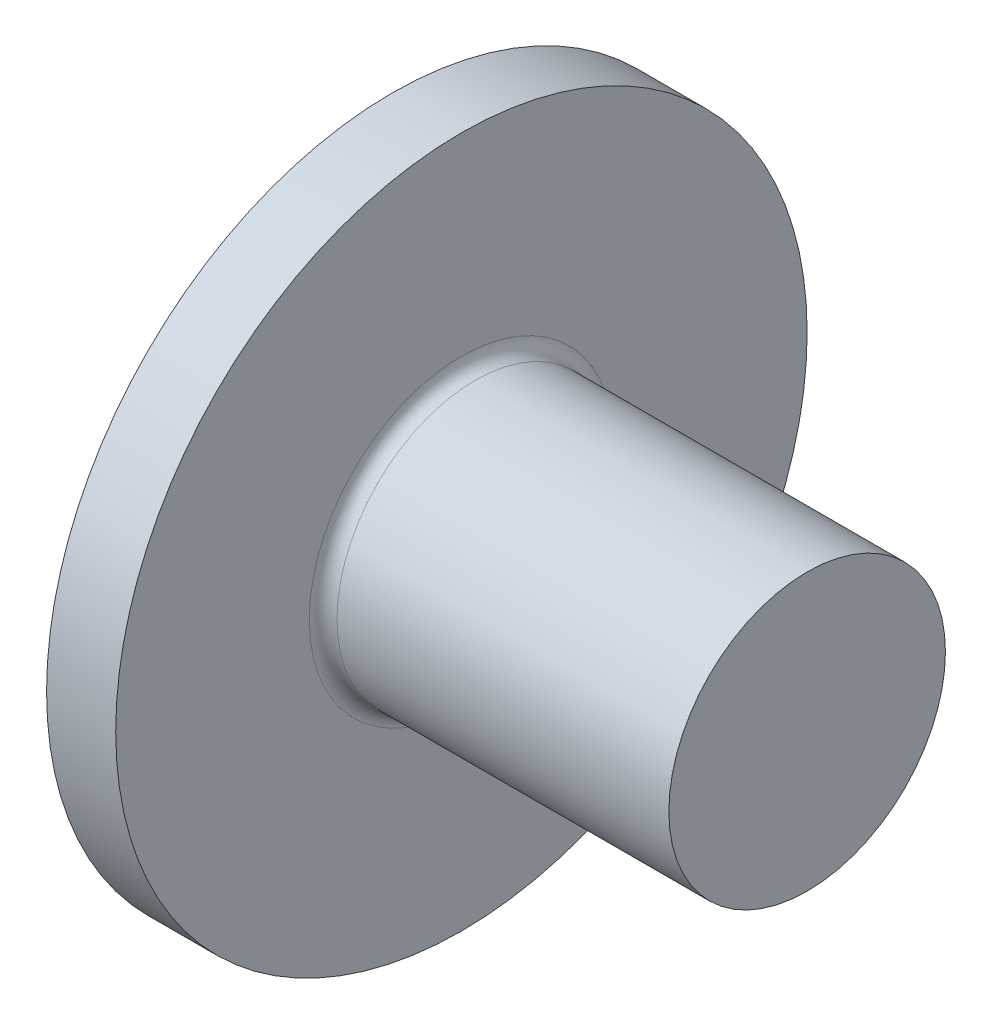
ISO-10303-21;
HEADER;
FILE_DESCRIPTION(('STEP AP214'),'2;1');
FILE_NAME('part.step','',(''),(''),'','','');
FILE_SCHEMA(('AUTOMOTIVE_DESIGN { 1 0 10303 214 1 1 1 1 }'));
ENDSEC;
DATA;
#1=APPLICATION_CONTEXT('core data for automotive mechanical design processes');
#2=APPLICATION_PROTOCOL_DEFINITION('international standard','automotive_design',2000,#1);
#3=PRODUCT_CONTEXT('',#1,'mechanical');
#4=PRODUCT('Part','Part','',(#3));
#5=PRODUCT_RELATED_PRODUCT_CATEGORY('part','',(#4));
#6=PRODUCT_DEFINITION_FORMATION('','',#4);
#7=PRODUCT_DEFINITION_CONTEXT('part definition',#1,'design');
#8=PRODUCT_DEFINITION('design','',#6,#7);
#9=PRODUCT_DEFINITION_SHAPE('','',#8);
#10=(LENGTH_UNIT() NAMED_UNIT(*) SI_UNIT(.MILLI.,.METRE.));
#11=(NAMED_UNIT(*) PLANE_ANGLE_UNIT() SI_UNIT($,.RADIAN.));
#12=(NAMED_UNIT(*) SI_UNIT($,.STERADIAN.) SOLID_ANGLE_UNIT());
#13=UNCERTAINTY_MEASURE_WITH_UNIT(LENGTH_MEASURE(1.E-05),#10,'distance_accuracy_value','');
#14=(GEOMETRIC_REPRESENTATION_CONTEXT(3) GLOBAL_UNCERTAINTY_ASSIGNED_CONTEXT((#13)) GLOBAL_UNIT_ASSIGNED_CONTEXT((#10,
#11,#12)) REPRESENTATION_CONTEXT('',''));
#15=CARTESIAN_POINT('',(0.,0.,0.));
#16=DIRECTION('',(0.,0.,1.));
#17=DIRECTION('',(1.,0.,0.));
#18=AXIS2_PLACEMENT_3D('',#15,#16,#17);
#19=CARTESIAN_POINT('',(0.,-2.15,0.514999999999999));
#20=DIRECTION('',(0.,0.,1.));
#21=DIRECTION('',(1.,0.,0.));
#22=AXIS2_PLACEMENT_3D('',#19,#20,#21);
#23=PLANE('',#22);
#24=CARTESIAN_POINT('',(-1.79298661274692,-1.19150572211576,0.514999999999999));
#25=CARTESIAN_POINT('',(-1.43619693826883,-1.16432131968278,0.514999999999999));
#26=CARTESIAN_POINT('',(-1.07941761560723,-1.13699981932845,0.514999999999999));
#27=CARTESIAN_POINT('',(-0.365884361106665,-1.08199408818658,0.514999999999999));
#28=CARTESIAN_POINT('',(-0.00913042946924694,-1.05430985478591,0.514999999999999));
#29=CARTESIAN_POINT('',(0.704342147946593,-0.99849051732371,0.514999999999999));
#30=CARTESIAN_POINT('',(1.06106079373135,-0.970355413343281,0.515));
#31=CARTESIAN_POINT('',(1.77444976866867,-0.913501553756457,0.515));
#32=CARTESIAN_POINT('',(2.13112009806674,-0.88478280123706,0.515));
#33=CARTESIAN_POINT('',(2.86788517328833,-0.824652093056656,0.515));
#34=CARTESIAN_POINT('',(3.24797561760216,-0.7931873300006,0.515));
#35=CARTESIAN_POINT('',(4.00804997853674,-0.729017811285515,0.515000000000001));
#36=CARTESIAN_POINT('',(4.38803389587504,-0.696313064191294,0.515000000000001));
#37=CARTESIAN_POINT('',(4.95789304042274,-0.645842729737196,0.515000000000001));
#38=CARTESIAN_POINT('',(5.14783071731973,-0.628783367168781,0.515000000000001));
#39=CARTESIAN_POINT('',(5.52764992575619,-0.594057293430921,0.515000000000001));
#40=CARTESIAN_POINT('',(5.71753145749917,-0.576390584490719,0.515000000000001));
#41=CARTESIAN_POINT('',(6.09722599136996,-0.540275025810562,0.515000000000001));
#42=CARTESIAN_POINT('',(6.28703899147881,-0.521826154666185,0.515000000000001));
#43=CARTESIAN_POINT('',(6.66655622713414,-0.483821208979671,0.515000000000001));
#44=CARTESIAN_POINT('',(6.85626046127055,-0.464265120397086,0.515000000000001));
#45=CARTESIAN_POINT('',(7.04589038802165,-0.443992893773562,0.515000000000002));
#46=B_SPLINE_CURVE_WITH_KNOTS('',3,(#24,#25,#26,#27,#28,#29,#30,#31,#32,#33,#34,#35,#36,#37,#38,
#39,#40,#41,#42,#43,#44,#45),.UNSPECIFIED.,.F.,.F.,(4,2,2,2,2,2,2,2,2,2,4),(0.,1.07347147993626,
2.14695069744496,3.22042972187302,4.2939030700023,5.43807363644059,6.58223630131249,
7.15434224418944,7.72644608739511,8.29856559674446,8.87069236267526),.UNSPECIFIED.);
#47=CARTESIAN_POINT('',(2.34,-0.867712978980554,0.515));
#48=VERTEX_POINT('',#47);
#49=CARTESIAN_POINT('',(0.118084953478184,-1.04432581319673,0.514999999999999));
#50=VERTEX_POINT('',#49);
#51=EDGE_CURVE('E331',#48,#50,#46,.F.);
#52=ORIENTED_EDGE('',*,*,#51,.F.);
#53=DIRECTION('',(0.,1.,0.));
#54=VECTOR('',#53,1.);
#55=CARTESIAN_POINT('',(2.34,-2.1065246820908,0.515));
#56=LINE('',#55,#54);
#57=CARTESIAN_POINT('',(2.34,-2.1065246820908,0.515));
#58=VERTEX_POINT('',#57);
#59=EDGE_CURVE('E290',#58,#48,#56,.T.);
#60=ORIENTED_EDGE('',*,*,#59,.F.);
#61=DIRECTION('',(0.999827451413598,0.0185759898737385,0.));
#62=VECTOR('',#61,1.);
#63=CARTESIAN_POINT('',(0.,-2.15,0.514999999999999));
#64=LINE('',#63,#62);
#65=CARTESIAN_POINT('',(0.434654293272697,-2.14192447282879,0.514999999999999));
#66=VERTEX_POINT('',#65);
#67=EDGE_CURVE('E276',#66,#58,#64,.T.);
#68=ORIENTED_EDGE('',*,*,#67,.F.);
#69=CARTESIAN_POINT('',(5.8,0.,0.515000000000001));
#70=DIRECTION('',(0.,0.,1.));
#71=DIRECTION('',(1.,0.,0.));
#72=AXIS2_PLACEMENT_3D('',#69,#70,#71);
#73=CIRCLE('',#72,5.77709053070834);
#74=EDGE_CURVE('E214',#50,#66,#73,.T.);
#75=ORIENTED_EDGE('',*,*,#74,.F.);
#76=EDGE_LOOP('',(#52,#60,#68,#75));
#77=FACE_BOUND('',#76,.T.);
#78=ADVANCED_FACE('F40',(#77),#23,.F.);
#79=CARTESIAN_POINT('',(0.,2.15,-0.515));
#80=DIRECTION('',(0.,0.,-1.));
#81=DIRECTION('',(0.,1.,0.));
#82=AXIS2_PLACEMENT_3D('',#79,#80,#81);
#83=PLANE('',#82);
#84=CARTESIAN_POINT('',(-1.79298661274692,-1.19150572211576,-0.515));
#85=CARTESIAN_POINT('',(-1.43619693826883,-1.16432131968278,-0.515));
#86=CARTESIAN_POINT('',(-1.07941761560723,-1.13699981932845,-0.515));
#87=CARTESIAN_POINT('',(-0.365884361106664,-1.08199408818658,-0.515));
#88=CARTESIAN_POINT('',(-0.0091304294692464,-1.05430985478591,-0.515));
#89=CARTESIAN_POINT('',(0.704342147946593,-0.99849051732371,-0.515));
#90=CARTESIAN_POINT('',(1.06106079373135,-0.970355413343281,-0.515));
#91=CARTESIAN_POINT('',(1.77444976866867,-0.913501553756457,-0.515));
#92=CARTESIAN_POINT('',(2.13112009806674,-0.884782801237059,-0.515));
#93=CARTESIAN_POINT('',(2.86788517328833,-0.824652093056656,-0.515));
#94=CARTESIAN_POINT('',(3.24797561760216,-0.7931873300006,-0.515));
#95=CARTESIAN_POINT('',(4.00804997853675,-0.729017811285515,-0.515));
#96=CARTESIAN_POINT('',(4.38803389587504,-0.696313064191294,-0.515000000000001));
#97=CARTESIAN_POINT('',(4.95789304042275,-0.645842729737197,-0.515000000000001));
#98=CARTESIAN_POINT('',(5.14783071731973,-0.628783367168782,-0.515000000000001));
#99=CARTESIAN_POINT('',(5.52764992575619,-0.594057293430921,-0.515000000000001));
#100=CARTESIAN_POINT('',(5.71753145749917,-0.57639058449072,-0.515000000000001));
#101=CARTESIAN_POINT('',(6.09722599136996,-0.540275025810562,-0.515000000000001));
#102=CARTESIAN_POINT('',(6.28703899147882,-0.521826154666185,-0.515000000000001));
#103=CARTESIAN_POINT('',(6.66655622713415,-0.483821208979671,-0.515000000000001));
#104=CARTESIAN_POINT('',(6.85626046127055,-0.464265120397087,-0.515000000000001));
#105=CARTESIAN_POINT('',(7.04589038802165,-0.443992893773562,-0.515000000000001));
#106=B_SPLINE_CURVE_WITH_KNOTS('',3,(#84,#85,#86,#87,#88,#89,#90,#91,#92,#93,#94,#95,#96,#97,
#98,#99,#100,#101,#102,#103,#104,#105),.UNSPECIFIED.,.F.,.F.,(4,2,2,2,2,2,2,2,2,2,4),(0.,
1.07347147993626,2.14695069744496,3.22042972187302,4.2939030700023,5.4380736364406,
6.58223630131249,7.15434224418944,7.72644608739512,8.29856559674446,8.87069236267526),.UNSPECIFIED.);
#107=CARTESIAN_POINT('',(0.118084953478187,-1.04432581319674,-0.515));
#108=VERTEX_POINT('',#107);
#109=CARTESIAN_POINT('',(2.34,-0.867712978980554,-0.515));
#110=VERTEX_POINT('',#109);
#111=EDGE_CURVE('E323',#108,#110,#106,.T.);
#112=ORIENTED_EDGE('',*,*,#111,.F.);
#113=CARTESIAN_POINT('',(5.8,0.,-0.515000000000001));
#114=DIRECTION('',(0.,0.,-1.));
#115=DIRECTION('',(0.,1.,0.));
#116=AXIS2_PLACEMENT_3D('',#113,#114,#115);
#117=CIRCLE('',#116,5.77709053070834);
#118=CARTESIAN_POINT('',(0.434654293272697,-2.14192447282879,-0.515));
#119=VERTEX_POINT('',#118);
#120=EDGE_CURVE('E219',#119,#108,#117,.T.);
#121=ORIENTED_EDGE('',*,*,#120,.F.);
#122=DIRECTION('',(0.999827451413598,0.0185759898737385,0.));
#123=VECTOR('',#122,1.);
#124=CARTESIAN_POINT('',(0.,-2.15,-0.515));
#125=LINE('',#124,#123);
#126=CARTESIAN_POINT('',(2.34,-2.1065246820908,-0.515000000000001));
#127=VERTEX_POINT('',#126);
#128=EDGE_CURVE('E279',#119,#127,#125,.T.);
#129=ORIENTED_EDGE('',*,*,#128,.T.);
#130=DIRECTION('',(0.,-1.,0.));
#131=VECTOR('',#130,1.);
#132=CARTESIAN_POINT('',(2.34,2.1065246820908,-0.515));
#133=LINE('',#132,#131);
#134=EDGE_CURVE('E289',#110,#127,#133,.T.);
#135=ORIENTED_EDGE('',*,*,#134,.F.);
#136=EDGE_LOOP('',(#112,#121,#129,#135));
#137=FACE_BOUND('',#136,.T.);
#138=ADVANCED_FACE('F172',(#137),#83,.F.);
#139=CARTESIAN_POINT('',(5.8,0.,0.));
#140=DIRECTION('',(-1.,0.,0.));
#141=DIRECTION('',(0.,1.,0.));
#142=AXIS2_PLACEMENT_3D('',#139,#140,#141);
#143=SPHERICAL_SURFACE('',#142,5.8);
#144=CARTESIAN_POINT('',(2.05,0.,0.));
#145=DIRECTION('',(1.,0.,0.));
#146=DIRECTION('',(0.,0.,-1.));
#147=AXIS2_PLACEMENT_3D('',#144,#145,#146);
#148=CIRCLE('',#147,4.42464687856557);
#149=CARTESIAN_POINT('',(2.05,0.,-4.42464687856557));
#150=VERTEX_POINT('',#149);
#151=EDGE_CURVE('E312',#150,#150,#148,.F.);
#152=ORIENTED_EDGE('',*,*,#151,.T.);
#153=EDGE_LOOP('',(#152));
#154=FACE_BOUND('',#153,.T.);
#155=CARTESIAN_POINT('',(0.118084953478184,0.,0.));
#156=DIRECTION('',(1.,0.,0.));
#157=DIRECTION('',(0.,0.,-1.));
#158=AXIS2_PLACEMENT_3D('',#155,#156,#157);
#159=CIRCLE('',#158,1.16440603060489);
#160=CARTESIAN_POINT('',(0.118084953478184,-0.514999999999996,-1.04432581319673));
#161=VERTEX_POINT('',#160);
#162=EDGE_CURVE('E317',#161,#108,#159,.F.);
#163=ORIENTED_EDGE('',*,*,#162,.F.);
#164=CARTESIAN_POINT('',(5.8,-0.515000000000001,0.));
#165=DIRECTION('',(0.,-1.,0.));
#166=DIRECTION('',(0.,0.,-1.));
#167=AXIS2_PLACEMENT_3D('',#164,#165,#166);
#168=CIRCLE('',#167,5.77709053070834);
#169=CARTESIAN_POINT('',(0.434654293272697,-0.514999999999992,-2.14192447282879));
#170=VERTEX_POINT('',#169);
#171=EDGE_CURVE('E230',#161,#170,#168,.T.);
#172=ORIENTED_EDGE('',*,*,#171,.T.);
#173=CARTESIAN_POINT('',(5.83793009599905,0.,-2.04153595433537));
#174=DIRECTION('',(0.0185759898737385,0.,-0.999827451413598));
#175=DIRECTION('',(-0.999827451413598,0.,-0.0185759898737385));
#176=AXIS2_PLACEMENT_3D('',#173,#174,#175);
#177=CIRCLE('',#176,5.42869157854574);
#178=CARTESIAN_POINT('',(0.434654293272697,0.515000000000008,-2.14192447282879));
#179=VERTEX_POINT('',#178);
#180=EDGE_CURVE('E53',#170,#179,#177,.T.);
#181=ORIENTED_EDGE('',*,*,#180,.T.);
#182=CARTESIAN_POINT('',(5.8,0.515000000000001,0.));
#183=DIRECTION('',(0.,1.,0.));
#184=DIRECTION('',(0.,0.,1.));
#185=AXIS2_PLACEMENT_3D('',#182,#183,#184);
#186=CIRCLE('',#185,5.77709053070834);
#187=CARTESIAN_POINT('',(0.118084953478184,0.515000000000004,-1.04432581319673));
#188=VERTEX_POINT('',#187);
#189=EDGE_CURVE('E228',#179,#188,#186,.T.);
#190=ORIENTED_EDGE('',*,*,#189,.T.);
#191=CARTESIAN_POINT('',(0.118084953478187,1.04432581319674,-0.515));
#192=VERTEX_POINT('',#191);
#193=EDGE_CURVE('E338',#192,#188,#159,.F.);
#194=ORIENTED_EDGE('',*,*,#193,.F.);
#195=CARTESIAN_POINT('',(0.434654293272697,2.14192447282879,-0.515));
#196=VERTEX_POINT('',#195);
#197=EDGE_CURVE('E314',#192,#196,#117,.T.);
#198=ORIENTED_EDGE('',*,*,#197,.T.);
#199=CARTESIAN_POINT('',(5.83793009599905,2.04153595433537,0.));
#200=DIRECTION('',(0.0185759898737385,0.999827451413598,0.));
#201=DIRECTION('',(-0.999827451413598,0.0185759898737385,0.));
#202=AXIS2_PLACEMENT_3D('',#199,#200,#201);
#203=CIRCLE('',#202,5.42869157854574);
#204=CARTESIAN_POINT('',(0.434654293272697,2.14192447282879,0.515));
#205=VERTEX_POINT('',#204);
#206=EDGE_CURVE('E212',#196,#205,#203,.T.);
#207=ORIENTED_EDGE('',*,*,#206,.T.);
#208=CARTESIAN_POINT('',(0.118084953478184,1.04432581319673,0.514999999999999));
#209=VERTEX_POINT('',#208);
#210=EDGE_CURVE('E200',#205,#209,#73,.T.);
#211=ORIENTED_EDGE('',*,*,#210,.T.);
#212=CARTESIAN_POINT('',(0.118084953478187,0.514999999999996,1.04432581319674));
#213=VERTEX_POINT('',#212);
#214=EDGE_CURVE('E210',#213,#209,#159,.F.);
#215=ORIENTED_EDGE('',*,*,#214,.F.);
#216=CARTESIAN_POINT('',(0.434654293272697,0.514999999999993,2.14192447282879));
#217=VERTEX_POINT('',#216);
#218=EDGE_CURVE('E247',#213,#217,#186,.T.);
#219=ORIENTED_EDGE('',*,*,#218,.T.);
#220=CARTESIAN_POINT('',(5.83793009599905,0.,2.04153595433537));
#221=DIRECTION('',(0.0185759898737385,0.,0.999827451413598));
#222=DIRECTION('',(0.999827451413598,0.,-0.0185759898737385));
#223=AXIS2_PLACEMENT_3D('',#220,#221,#222);
#224=CIRCLE('',#223,5.42869157854574);
#225=CARTESIAN_POINT('',(0.434654293272697,-0.515000000000007,2.14192447282879));
#226=VERTEX_POINT('',#225);
#227=EDGE_CURVE('E217',#217,#226,#224,.T.);
#228=ORIENTED_EDGE('',*,*,#227,.T.);
#229=CARTESIAN_POINT('',(0.118084953478187,-0.515000000000003,1.04432581319674));
#230=VERTEX_POINT('',#229);
#231=EDGE_CURVE('E275',#226,#230,#168,.T.);
#232=ORIENTED_EDGE('',*,*,#231,.T.);
#233=EDGE_CURVE('E204',#50,#230,#159,.F.);
#234=ORIENTED_EDGE('',*,*,#233,.F.);
#235=ORIENTED_EDGE('',*,*,#74,.T.);
#236=CARTESIAN_POINT('',(5.83793009599905,-2.04153595433537,0.));
#237=DIRECTION('',(0.0185759898737385,-0.999827451413598,0.));
#238=DIRECTION('',(0.999827451413598,0.0185759898737385,0.));
#239=AXIS2_PLACEMENT_3D('',#236,#237,#238);
#240=CIRCLE('',#239,5.42869157854574);
#241=EDGE_CURVE('E213',#66,#119,#240,.T.);
#242=ORIENTED_EDGE('',*,*,#241,.T.);
#243=ORIENTED_EDGE('',*,*,#120,.T.);
#244=EDGE_LOOP('',(#163,#172,#181,#190,#194,#198,#207,#211,#215,#219,#228,#232,#234,#235,#242,#243));
#245=FACE_BOUND('',#244,.T.);
#246=ADVANCED_FACE('F179',(#154,#245),#143,.T.);
#247=CARTESIAN_POINT('',(-1.79298661274692,1.19150572211576,0.514999999999999));
#248=CARTESIAN_POINT('',(-1.43619693826883,1.16432131968278,0.514999999999999));
#249=CARTESIAN_POINT('',(-1.07941761560723,1.13699981932845,0.514999999999999));
#250=CARTESIAN_POINT('',(-0.365884361106665,1.08199408818658,0.514999999999999));
#251=CARTESIAN_POINT('',(-0.00913042946924678,1.05430985478591,0.514999999999999));
#252=CARTESIAN_POINT('',(0.704342147946593,0.99849051732371,0.514999999999999));
#253=CARTESIAN_POINT('',(1.06106079373135,0.970355413343281,0.515));
#254=CARTESIAN_POINT('',(1.77444976866867,0.913501553756458,0.515));
#255=CARTESIAN_POINT('',(2.13112009806674,0.88478280123706,0.515));
#256=CARTESIAN_POINT('',(2.86788517328833,0.824652093056656,0.515));
#257=CARTESIAN_POINT('',(3.24797561760217,0.7931873300006,0.515));
#258=CARTESIAN_POINT('',(4.00804997853675,0.729017811285515,0.515000000000001));
#259=CARTESIAN_POINT('',(4.38803389587504,0.696313064191294,0.515000000000001));
#260=CARTESIAN_POINT('',(4.95789304042275,0.645842729737196,0.515000000000001));
#261=CARTESIAN_POINT('',(5.14783071731973,0.628783367168781,0.515000000000001));
#262=CARTESIAN_POINT('',(5.52764992575619,0.594057293430921,0.515000000000001));
#263=CARTESIAN_POINT('',(5.71753145749917,0.576390584490719,0.515000000000001));
#264=CARTESIAN_POINT('',(6.09722599136996,0.540275025810561,0.515000000000001));
#265=CARTESIAN_POINT('',(6.28703899147882,0.521826154666184,0.515000000000001));
#266=CARTESIAN_POINT('',(6.66655622713415,0.48382120897967,0.515000000000001));
#267=CARTESIAN_POINT('',(6.85626046127055,0.464265120397086,0.515000000000001));
#268=CARTESIAN_POINT('',(7.04589038802165,0.443992893773561,0.515000000000002));
#269=B_SPLINE_CURVE_WITH_KNOTS('',3,(#247,#248,#249,#250,#251,#252,#253,#254,#255,#256,#257,
#258,#259,#260,#261,#262,#263,#264,#265,#266,#267,#268),.UNSPECIFIED.,.F.,.F.,(4,2,2,2,2,2,2,2,
2,2,4),(0.,1.07347147993626,2.14695069744496,3.22042972187302,4.2939030700023,5.4380736364406,
6.58223630131249,7.15434224418944,7.72644608739511,8.29856559674446,8.87069236267526),.UNSPECIFIED.);
#270=CARTESIAN_POINT('',(2.34,0.867712978980554,0.515));
#271=VERTEX_POINT('',#270);
#272=EDGE_CURVE('E198',#209,#271,#269,.T.);
#273=ORIENTED_EDGE('',*,*,#272,.F.);
#274=ORIENTED_EDGE('',*,*,#210,.F.);
#275=DIRECTION('',(0.999827451413598,-0.0185759898737385,0.));
#276=VECTOR('',#275,1.);
#277=CARTESIAN_POINT('',(0.,2.15,0.514999999999999));
#278=LINE('',#277,#276);
#279=CARTESIAN_POINT('',(2.34,2.1065246820908,0.515));
#280=VERTEX_POINT('',#279);
#281=EDGE_CURVE('E67',#205,#280,#278,.T.);
#282=ORIENTED_EDGE('',*,*,#281,.T.);
#283=EDGE_CURVE('E202',#271,#280,#56,.T.);
#284=ORIENTED_EDGE('',*,*,#283,.F.);
#285=EDGE_LOOP('',(#273,#274,#282,#284));
#286=FACE_BOUND('',#285,.T.);
#287=ADVANCED_FACE('F175',(#286),#23,.F.);
#288=CARTESIAN_POINT('',(-1.79298661274692,1.19150572211576,-0.515));
#289=CARTESIAN_POINT('',(-1.43619693826883,1.16432131968278,-0.515));
#290=CARTESIAN_POINT('',(-1.07941761560723,1.13699981932845,-0.515));
#291=CARTESIAN_POINT('',(-0.365884361106664,1.08199408818658,-0.515));
#292=CARTESIAN_POINT('',(-0.00913042946924602,1.05430985478591,-0.515));
#293=CARTESIAN_POINT('',(0.704342147946593,0.99849051732371,-0.515));
#294=CARTESIAN_POINT('',(1.06106079373135,0.970355413343281,-0.515));
#295=CARTESIAN_POINT('',(1.77444976866867,0.913501553756458,-0.515));
#296=CARTESIAN_POINT('',(2.13112009806674,0.88478280123706,-0.515));
#297=CARTESIAN_POINT('',(2.86788517328833,0.824652093056656,-0.515));
#298=CARTESIAN_POINT('',(3.24797561760216,0.7931873300006,-0.515));
#299=CARTESIAN_POINT('',(4.00804997853675,0.729017811285515,-0.515));
#300=CARTESIAN_POINT('',(4.38803389587504,0.696313064191294,-0.515));
#301=CARTESIAN_POINT('',(4.95789304042275,0.645842729737197,-0.515));
#302=CARTESIAN_POINT('',(5.14783071731973,0.628783367168782,-0.515));
#303=CARTESIAN_POINT('',(5.52764992575619,0.594057293430921,-0.515));
#304=CARTESIAN_POINT('',(5.71753145749917,0.57639058449072,-0.515));
#305=CARTESIAN_POINT('',(6.09722599136996,0.540275025810562,-0.515));
#306=CARTESIAN_POINT('',(6.28703899147882,0.521826154666185,-0.515000000000001));
#307=CARTESIAN_POINT('',(6.66655622713415,0.483821208979671,-0.515000000000001));
#308=CARTESIAN_POINT('',(6.85626046127055,0.464265120397087,-0.515000000000001));
#309=CARTESIAN_POINT('',(7.04589038802165,0.443992893773563,-0.515000000000001));
#310=B_SPLINE_CURVE_WITH_KNOTS('',3,(#288,#289,#290,#291,#292,#293,#294,#295,#296,#297,#298,
#299,#300,#301,#302,#303,#304,#305,#306,#307,#308,#309),.UNSPECIFIED.,.F.,.F.,(4,2,2,2,2,2,2,2,
2,2,4),(0.,1.07347147993627,2.14695069744496,3.22042972187302,4.2939030700023,5.43807363644059,
6.58223630131249,7.15434224418944,7.72644608739511,8.29856559674446,8.87069236267526),.UNSPECIFIED.);
#311=CARTESIAN_POINT('',(2.34,0.867712978980554,-0.515));
#312=VERTEX_POINT('',#311);
#313=EDGE_CURVE('E347',#312,#192,#310,.F.);
#314=ORIENTED_EDGE('',*,*,#313,.F.);
#315=CARTESIAN_POINT('',(2.34,2.1065246820908,-0.515));
#316=VERTEX_POINT('',#315);
#317=EDGE_CURVE('E291',#316,#312,#133,.T.);
#318=ORIENTED_EDGE('',*,*,#317,.F.);
#319=DIRECTION('',(0.999827451413598,-0.0185759898737385,0.));
#320=VECTOR('',#319,1.);
#321=CARTESIAN_POINT('',(0.,2.15,-0.515));
#322=LINE('',#321,#320);
#323=EDGE_CURVE('E283',#196,#316,#322,.T.);
#324=ORIENTED_EDGE('',*,*,#323,.F.);
#325=ORIENTED_EDGE('',*,*,#197,.F.);
#326=EDGE_LOOP('',(#314,#318,#324,#325));
#327=FACE_BOUND('',#326,.T.);
#328=ADVANCED_FACE('F182',(#327),#83,.F.);
#329=CARTESIAN_POINT('',(2.34,2.1065246820908,0.515));
#330=DIRECTION('',(-1.,0.,0.));
#331=DIRECTION('',(0.,0.,1.));
#332=AXIS2_PLACEMENT_3D('',#329,#330,#331);
#333=PLANE('',#332);
#334=ORIENTED_EDGE('',*,*,#59,.T.);
#335=CARTESIAN_POINT('',(2.34,0.,0.));
#336=DIRECTION('',(-1.,0.,0.));
#337=DIRECTION('',(0.,0.,1.));
#338=AXIS2_PLACEMENT_3D('',#335,#336,#337);
#339=CIRCLE('',#338,1.00903459499232);
#340=EDGE_CURVE('E335',#48,#110,#339,.F.);
#341=ORIENTED_EDGE('',*,*,#340,.T.);
#342=ORIENTED_EDGE('',*,*,#134,.T.);
#343=DIRECTION('',(0.,0.,1.));
#344=VECTOR('',#343,1.);
#345=CARTESIAN_POINT('',(2.34,-2.1065246820908,-0.515000000000001));
#346=LINE('',#345,#344);
#347=EDGE_CURVE('E285',#127,#58,#346,.T.);
#348=ORIENTED_EDGE('',*,*,#347,.T.);
#349=EDGE_LOOP('',(#334,#341,#342,#348));
#350=FACE_BOUND('',#349,.T.);
#351=ADVANCED_FACE('F192',(#350),#333,.T.);
#352=DIRECTION('',(0.,0.,1.));
#353=VECTOR('',#352,1.);
#354=CARTESIAN_POINT('',(2.34,-0.514999999999993,-2.10652468209081));
#355=LINE('',#354,#353);
#356=CARTESIAN_POINT('',(2.34,-0.514999999999993,-2.10652468209081));
#357=VERTEX_POINT('',#356);
#358=CARTESIAN_POINT('',(2.34,-0.514999999999997,-0.867712978980556));
#359=VERTEX_POINT('',#358);
#360=EDGE_CURVE('E245',#357,#359,#355,.T.);
#361=ORIENTED_EDGE('',*,*,#360,.T.);
#362=CARTESIAN_POINT('',(2.34,0.515000000000003,-0.867712978980552));
#363=VERTEX_POINT('',#362);
#364=EDGE_CURVE('E371',#359,#363,#339,.F.);
#365=ORIENTED_EDGE('',*,*,#364,.T.);
#366=DIRECTION('',(0.,0.,-1.));
#367=VECTOR('',#366,1.);
#368=CARTESIAN_POINT('',(2.34,0.514999999999993,2.10652468209081));
#369=LINE('',#368,#367);
#370=CARTESIAN_POINT('',(2.34,0.515000000000008,-2.1065246820908));
#371=VERTEX_POINT('',#370);
#372=EDGE_CURVE('E267',#363,#371,#369,.T.);
#373=ORIENTED_EDGE('',*,*,#372,.T.);
#374=DIRECTION('',(0.,-1.,0.));
#375=VECTOR('',#374,1.);
#376=CARTESIAN_POINT('',(2.34,0.515000000000008,-2.1065246820908));
#377=LINE('',#376,#375);
#378=EDGE_CURVE('E263',#371,#357,#377,.T.);
#379=ORIENTED_EDGE('',*,*,#378,.T.);
#380=EDGE_LOOP('',(#361,#365,#373,#379));
#381=FACE_BOUND('',#380,.T.);
#382=ADVANCED_FACE('F452',(#381),#333,.T.);
#383=ORIENTED_EDGE('',*,*,#317,.T.);
#384=EDGE_CURVE('E333',#312,#271,#339,.F.);
#385=ORIENTED_EDGE('',*,*,#384,.T.);
#386=ORIENTED_EDGE('',*,*,#283,.T.);
#387=DIRECTION('',(0.,0.,-1.));
#388=VECTOR('',#387,1.);
#389=CARTESIAN_POINT('',(2.34,2.1065246820908,0.515));
#390=LINE('',#389,#388);
#391=EDGE_CURVE('E286',#280,#316,#390,.T.);
#392=ORIENTED_EDGE('',*,*,#391,.T.);
#393=EDGE_LOOP('',(#383,#385,#386,#392));
#394=FACE_BOUND('',#393,.T.);
#395=ADVANCED_FACE('F376',(#394),#333,.T.);
#396=CARTESIAN_POINT('',(0.,0.514999999999992,2.15));
#397=DIRECTION('',(0.,1.,0.));
#398=DIRECTION('',(0.,0.,1.));
#399=AXIS2_PLACEMENT_3D('',#396,#397,#398);
#400=PLANE('',#399);
#401=CARTESIAN_POINT('',(-1.79298662893649,0.515000000000004,-1.19150572334907));
#402=CARTESIAN_POINT('',(-1.43619695230506,0.515000000000004,-1.16432132075638));
#403=CARTESIAN_POINT('',(-1.0794176274902,0.515000000000004,-1.13699982024121));
#404=CARTESIAN_POINT('',(-0.365884368683318,0.515000000000004,-1.08199408877401));
#405=CARTESIAN_POINT('',(-0.00913043489284162,0.515000000000004,-1.05430985520883));
#406=CARTESIAN_POINT('',(0.704342147969924,0.515000000000004,-0.998490517323278));
#407=CARTESIAN_POINT('',(1.06106079704843,0.515000000000004,-0.970355413082561));
#408=CARTESIAN_POINT('',(1.77444977857226,0.515000000000004,-0.913501552963536));
#409=CARTESIAN_POINT('',(2.1311201112631,0.515000000000004,-0.884782800172224));
#410=CARTESIAN_POINT('',(2.86788518977584,0.515000000000003,-0.824652091698035));
#411=CARTESIAN_POINT('',(3.24797563408862,0.515000000000003,-0.793187328627031));
#412=CARTESIAN_POINT('',(4.00804999502045,0.515000000000003,-0.729017809875384));
#413=CARTESIAN_POINT('',(4.38803391235703,0.515000000000003,-0.696313062759548));
#414=CARTESIAN_POINT('',(4.95789305690139,0.515000000000003,-0.645842728263865));
#415=CARTESIAN_POINT('',(5.14783073379719,0.515000000000003,-0.628783365680054));
#416=CARTESIAN_POINT('',(5.52764994223081,0.515000000000003,-0.594057291906934));
#417=CARTESIAN_POINT('',(5.71753147397213,0.515000000000003,-0.57639058294687));
#418=CARTESIAN_POINT('',(6.09722600783899,0.515000000000003,-0.540275024220593));
#419=CARTESIAN_POINT('',(6.28703900794559,0.515000000000003,-0.521826153049961));
#420=CARTESIAN_POINT('',(6.66655624359515,0.515000000000002,-0.483821207299953));
#421=CARTESIAN_POINT('',(6.85626047772805,0.515000000000002,-0.464265118680129));
#422=CARTESIAN_POINT('',(7.0458904044747,0.515000000000002,-0.443992892011578));
#423=B_SPLINE_CURVE_WITH_KNOTS('',3,(#401,#402,#403,#404,#405,#406,#407,#408,#409,#410,#411,
#412,#413,#414,#415,#416,#417,#418,#419,#420,#421,#422),.UNSPECIFIED.,.F.,.F.,(4,2,2,2,2,2,2,2,
2,2,4),(0.,1.07347148641402,2.14695071040071,3.22042974474083,4.29390310278196,5.43807366922081,
6.58223633409312,7.15434227697065,7.72644612017687,8.29856562952703,8.8706923954588),.UNSPECIFIED.);
#424=EDGE_CURVE('E367',#188,#363,#423,.T.);
#425=ORIENTED_EDGE('',*,*,#424,.F.);
#426=ORIENTED_EDGE('',*,*,#189,.F.);
#427=DIRECTION('',(0.999827451413598,0.,0.0185759898737385));
#428=VECTOR('',#427,1.);
#429=CARTESIAN_POINT('',(0.,0.515000000000008,-2.15));
#430=LINE('',#429,#428);
#431=EDGE_CURVE('E239',#179,#371,#430,.T.);
#432=ORIENTED_EDGE('',*,*,#431,.T.);
#433=ORIENTED_EDGE('',*,*,#372,.F.);
#434=EDGE_LOOP('',(#425,#426,#432,#433));
#435=FACE_BOUND('',#434,.T.);
#436=ADVANCED_FACE('F372',(#435),#400,.F.);
#437=CARTESIAN_POINT('',(0.,-0.514999999999992,-2.15));
#438=DIRECTION('',(0.,-1.,0.));
#439=DIRECTION('',(1.,0.,0.));
#440=AXIS2_PLACEMENT_3D('',#437,#438,#439);
#441=PLANE('',#440);
#442=CARTESIAN_POINT('',(-1.79298661274692,-0.514999999999995,-1.19150572211576));
#443=CARTESIAN_POINT('',(-1.43619693826883,-0.514999999999995,-1.16432131968278));
#444=CARTESIAN_POINT('',(-1.07941761560723,-0.514999999999995,-1.13699981932845));
#445=CARTESIAN_POINT('',(-0.365884361106664,-0.514999999999995,-1.08199408818658));
#446=CARTESIAN_POINT('',(-0.00913042946924656,-0.514999999999996,-1.05430985478591));
#447=CARTESIAN_POINT('',(0.704342147946593,-0.514999999999996,-0.998490517323712));
#448=CARTESIAN_POINT('',(1.06106079373135,-0.514999999999996,-0.970355413343283));
#449=CARTESIAN_POINT('',(1.77444976866867,-0.514999999999997,-0.913501553756459));
#450=CARTESIAN_POINT('',(2.13112009806674,-0.514999999999997,-0.884782801237061));
#451=CARTESIAN_POINT('',(2.86788517328833,-0.514999999999997,-0.824652093056658));
#452=CARTESIAN_POINT('',(3.24797561760217,-0.514999999999998,-0.793187330000602));
#453=CARTESIAN_POINT('',(4.00804997853675,-0.514999999999998,-0.729017811285517));
#454=CARTESIAN_POINT('',(4.38803389587504,-0.514999999999998,-0.696313064191296));
#455=CARTESIAN_POINT('',(4.95789304042275,-0.514999999999999,-0.645842729737198));
#456=CARTESIAN_POINT('',(5.14783071731973,-0.514999999999999,-0.628783367168783));
#457=CARTESIAN_POINT('',(5.52764992575619,-0.514999999999999,-0.594057293430922));
#458=CARTESIAN_POINT('',(5.71753145749917,-0.514999999999999,-0.576390584490721));
#459=CARTESIAN_POINT('',(6.09722599136996,-0.514999999999999,-0.540275025810563));
#460=CARTESIAN_POINT('',(6.28703899147882,-0.514999999999999,-0.521826154666186));
#461=CARTESIAN_POINT('',(6.66655622713415,-0.515,-0.483821208979672));
#462=CARTESIAN_POINT('',(6.85626046127055,-0.515,-0.464265120397088));
#463=CARTESIAN_POINT('',(7.04589038802165,-0.515,-0.443992893773563));
#464=B_SPLINE_CURVE_WITH_KNOTS('',3,(#442,#443,#444,#445,#446,#447,#448,#449,#450,#451,#452,
#453,#454,#455,#456,#457,#458,#459,#460,#461,#462,#463),.UNSPECIFIED.,.F.,.F.,(4,2,2,2,2,2,2,2,
2,2,4),(0.,1.07347147993626,2.14695069744496,3.22042972187302,4.2939030700023,5.43807363644059,
6.58223630131249,7.15434224418944,7.72644608739511,8.29856559674446,8.87069236267526),.UNSPECIFIED.);
#465=EDGE_CURVE('E252',#359,#161,#464,.F.);
#466=ORIENTED_EDGE('',*,*,#465,.F.);
#467=ORIENTED_EDGE('',*,*,#360,.F.);
#468=DIRECTION('',(0.999827451413598,0.,0.0185759898737385));
#469=VECTOR('',#468,1.);
#470=CARTESIAN_POINT('',(0.,-0.514999999999992,-2.15));
#471=LINE('',#470,#469);
#472=EDGE_CURVE('E236',#170,#357,#471,.T.);
#473=ORIENTED_EDGE('',*,*,#472,.F.);
#474=ORIENTED_EDGE('',*,*,#171,.F.);
#475=EDGE_LOOP('',(#466,#467,#473,#474));
#476=FACE_BOUND('',#475,.T.);
#477=ADVANCED_FACE('F243',(#476),#441,.F.);
#478=CARTESIAN_POINT('',(-1.79298661274692,-0.515000000000003,1.19150572211576));
#479=CARTESIAN_POINT('',(-1.43619693826883,-0.515000000000003,1.16432131968278));
#480=CARTESIAN_POINT('',(-1.07941761560723,-0.515000000000003,1.13699981932845));
#481=CARTESIAN_POINT('',(-0.365884361106665,-0.515000000000003,1.08199408818658));
#482=CARTESIAN_POINT('',(-0.00913042946924688,-0.515000000000003,1.05430985478591));
#483=CARTESIAN_POINT('',(0.704342147946593,-0.515000000000003,0.998490517323709));
#484=CARTESIAN_POINT('',(1.06106079373135,-0.515000000000003,0.970355413343279));
#485=CARTESIAN_POINT('',(1.77444976866867,-0.515000000000003,0.913501553756456));
#486=CARTESIAN_POINT('',(2.13112009806674,-0.515000000000003,0.884782801237058));
#487=CARTESIAN_POINT('',(2.86788517328833,-0.515000000000003,0.824652093056654));
#488=CARTESIAN_POINT('',(3.24797561760217,-0.515000000000003,0.793187330000598));
#489=CARTESIAN_POINT('',(4.00804997853675,-0.515000000000003,0.729017811285513));
#490=CARTESIAN_POINT('',(4.38803389587504,-0.515000000000003,0.696313064191292));
#491=CARTESIAN_POINT('',(4.95789304042275,-0.515000000000003,0.645842729737194));
#492=CARTESIAN_POINT('',(5.14783071731973,-0.515000000000003,0.628783367168779));
#493=CARTESIAN_POINT('',(5.52764992575619,-0.515000000000003,0.594057293430919));
#494=CARTESIAN_POINT('',(5.71753145749917,-0.515000000000003,0.576390584490718));
#495=CARTESIAN_POINT('',(6.09722599136996,-0.515000000000003,0.54027502581056));
#496=CARTESIAN_POINT('',(6.28703899147882,-0.515000000000003,0.521826154666183));
#497=CARTESIAN_POINT('',(6.66655622713415,-0.515000000000003,0.483821208979669));
#498=CARTESIAN_POINT('',(6.85626046127055,-0.515000000000003,0.464265120397084));
#499=CARTESIAN_POINT('',(7.04589038802165,-0.515000000000003,0.44399289377356));
#500=B_SPLINE_CURVE_WITH_KNOTS('',3,(#478,#479,#480,#481,#482,#483,#484,#485,#486,#487,#488,
#489,#490,#491,#492,#493,#494,#495,#496,#497,#498,#499),.UNSPECIFIED.,.F.,.F.,(4,2,2,2,2,2,2,2,
2,2,4),(0.,1.07347147993626,2.14695069744496,3.22042972187302,4.2939030700023,5.4380736364406,
6.58223630131249,7.15434224418944,7.72644608739511,8.29856559674446,8.87069236267526),.UNSPECIFIED.);
#501=CARTESIAN_POINT('',(2.34,-0.515000000000003,0.867712978980552));
#502=VERTEX_POINT('',#501);
#503=EDGE_CURVE('E205',#230,#502,#500,.T.);
#504=ORIENTED_EDGE('',*,*,#503,.F.);
#505=ORIENTED_EDGE('',*,*,#231,.F.);
#506=DIRECTION('',(0.999827451413598,0.,-0.0185759898737385));
#507=VECTOR('',#506,1.);
#508=CARTESIAN_POINT('',(0.,-0.515000000000007,2.15));
#509=LINE('',#508,#507);
#510=CARTESIAN_POINT('',(2.34,-0.515000000000007,2.1065246820908));
#511=VERTEX_POINT('',#510);
#512=EDGE_CURVE('E249',#226,#511,#509,.T.);
#513=ORIENTED_EDGE('',*,*,#512,.T.);
#514=EDGE_CURVE('E272',#502,#511,#355,.T.);
#515=ORIENTED_EDGE('',*,*,#514,.F.);
#516=EDGE_LOOP('',(#504,#505,#513,#515));
#517=FACE_BOUND('',#516,.T.);
#518=ADVANCED_FACE('F425',(#517),#441,.F.);
#519=CARTESIAN_POINT('',(-1.79298662893649,0.514999999999996,1.19150572334907));
#520=CARTESIAN_POINT('',(-1.43619695230506,0.514999999999996,1.16432132075639));
#521=CARTESIAN_POINT('',(-1.0794176274902,0.514999999999996,1.13699982024122));
#522=CARTESIAN_POINT('',(-0.365884368683318,0.514999999999996,1.08199408877401));
#523=CARTESIAN_POINT('',(-0.00913043489284113,0.514999999999996,1.05430985520883));
#524=CARTESIAN_POINT('',(0.704342147969924,0.514999999999997,0.998490517323282));
#525=CARTESIAN_POINT('',(1.06106079704843,0.514999999999997,0.970355413082564));
#526=CARTESIAN_POINT('',(1.77444977857226,0.514999999999997,0.913501552963539));
#527=CARTESIAN_POINT('',(2.1311201112631,0.514999999999997,0.884782800172228));
#528=CARTESIAN_POINT('',(2.86788518977584,0.514999999999997,0.824652091698039));
#529=CARTESIAN_POINT('',(3.24797563408862,0.514999999999998,0.793187328627035));
#530=CARTESIAN_POINT('',(4.00804999502045,0.514999999999998,0.729017809875387));
#531=CARTESIAN_POINT('',(4.38803391235704,0.514999999999998,0.696313062759552));
#532=CARTESIAN_POINT('',(4.9578930569014,0.514999999999998,0.645842728263868));
#533=CARTESIAN_POINT('',(5.14783073379719,0.514999999999998,0.628783365680058));
#534=CARTESIAN_POINT('',(5.52764994223081,0.514999999999998,0.594057291906938));
#535=CARTESIAN_POINT('',(5.71753147397213,0.514999999999999,0.576390582946873));
#536=CARTESIAN_POINT('',(6.097226007839,0.514999999999999,0.540275024220597));
#537=CARTESIAN_POINT('',(6.28703900794559,0.514999999999999,0.521826153049965));
#538=CARTESIAN_POINT('',(6.66655624359515,0.514999999999999,0.483821207299957));
#539=CARTESIAN_POINT('',(6.85626047772805,0.514999999999999,0.464265118680133));
#540=CARTESIAN_POINT('',(7.0458904044747,0.514999999999999,0.443992892011581));
#541=B_SPLINE_CURVE_WITH_KNOTS('',3,(#519,#520,#521,#522,#523,#524,#525,#526,#527,#528,#529,
#530,#531,#532,#533,#534,#535,#536,#537,#538,#539,#540),.UNSPECIFIED.,.F.,.F.,(4,2,2,2,2,2,2,2,
2,2,4),(0.,1.07347148641402,2.14695071040071,3.22042974474083,4.29390310278196,5.43807366922082,
6.58223633409312,7.15434227697065,7.72644612017687,8.29856562952703,8.87069239545879),.UNSPECIFIED.);
#542=CARTESIAN_POINT('',(2.34,0.514999999999997,0.867712978980555));
#543=VERTEX_POINT('',#542);
#544=EDGE_CURVE('E11',#543,#213,#541,.F.);
#545=ORIENTED_EDGE('',*,*,#544,.F.);
#546=CARTESIAN_POINT('',(2.34,0.514999999999993,2.10652468209081));
#547=VERTEX_POINT('',#546);
#548=EDGE_CURVE('E268',#547,#543,#369,.T.);
#549=ORIENTED_EDGE('',*,*,#548,.F.);
#550=DIRECTION('',(0.999827451413598,0.,-0.0185759898737385));
#551=VECTOR('',#550,1.);
#552=CARTESIAN_POINT('',(0.,0.514999999999992,2.15));
#553=LINE('',#552,#551);
#554=EDGE_CURVE('E261',#217,#547,#553,.T.);
#555=ORIENTED_EDGE('',*,*,#554,.F.);
#556=ORIENTED_EDGE('',*,*,#218,.F.);
#557=EDGE_LOOP('',(#545,#549,#555,#556));
#558=FACE_BOUND('',#557,.T.);
#559=ADVANCED_FACE('F378',(#558),#400,.F.);
#560=CARTESIAN_POINT('',(-6.34999999999999,0.,0.));
#561=DIRECTION('',(-1.,0.,0.));
#562=DIRECTION('',(0.,0.,1.));
#563=AXIS2_PLACEMENT_3D('',#560,#561,#562);
#564=CYLINDRICAL_SURFACE('',#563,2.);
#565=CARTESIAN_POINT('',(3.25,0.,0.));
#566=DIRECTION('',(-1.,0.,0.));
#567=DIRECTION('',(0.,0.,1.));
#568=AXIS2_PLACEMENT_3D('',#565,#566,#567);
#569=CIRCLE('',#568,2.);
#570=CARTESIAN_POINT('',(3.25,0.,2.));
#571=VERTEX_POINT('',#570);
#572=EDGE_CURVE('E309',#571,#571,#569,.F.);
#573=ORIENTED_EDGE('',*,*,#572,.T.);
#574=EDGE_LOOP('',(#573));
#575=FACE_BOUND('',#574,.T.);
#576=CARTESIAN_POINT('',(8.05,0.,0.));
#577=DIRECTION('',(-1.,0.,0.));
#578=DIRECTION('',(0.,0.,1.));
#579=AXIS2_PLACEMENT_3D('',#576,#577,#578);
#580=CIRCLE('',#579,2.);
#581=CARTESIAN_POINT('',(8.05,0.,2.));
#582=VERTEX_POINT('',#581);
#583=EDGE_CURVE('E303',#582,#582,#580,.T.);
#584=ORIENTED_EDGE('',*,*,#583,.T.);
#585=EDGE_LOOP('',(#584));
#586=FACE_BOUND('',#585,.T.);
#587=ADVANCED_FACE('F418',(#575,#586),#564,.T.);
#588=CARTESIAN_POINT('',(8.05,2.,0.));
#589=DIRECTION('',(1.,0.,0.));
#590=DIRECTION('',(0.,0.,-1.));
#591=AXIS2_PLACEMENT_3D('',#588,#589,#590);
#592=PLANE('',#591);
#593=ORIENTED_EDGE('',*,*,#583,.F.);
#594=EDGE_LOOP('',(#593));
#595=FACE_BOUND('',#594,.T.);
#596=ADVANCED_FACE('F412',(#595),#592,.T.);
#597=CARTESIAN_POINT('',(2.05,5.,0.));
#598=DIRECTION('',(1.,0.,0.));
#599=DIRECTION('',(0.,0.,-1.));
#600=AXIS2_PLACEMENT_3D('',#597,#598,#599);
#601=PLANE('',#600);
#602=ORIENTED_EDGE('',*,*,#151,.F.);
#603=EDGE_LOOP('',(#602));
#604=FACE_BOUND('',#603,.T.);
#605=CARTESIAN_POINT('',(2.05,0.,0.));
#606=DIRECTION('',(-1.,0.,0.));
#607=DIRECTION('',(0.,0.,1.));
#608=AXIS2_PLACEMENT_3D('',#605,#606,#607);
#609=CIRCLE('',#608,5.);
#610=CARTESIAN_POINT('',(2.05,0.,5.));
#611=VERTEX_POINT('',#610);
#612=EDGE_CURVE('E300',#611,#611,#609,.T.);
#613=ORIENTED_EDGE('',*,*,#612,.T.);
#614=EDGE_LOOP('',(#613));
#615=FACE_BOUND('',#614,.T.);
#616=ADVANCED_FACE('F406',(#604,#615),#601,.F.);
#617=CARTESIAN_POINT('',(-6.34999999999999,0.,0.));
#618=DIRECTION('',(-1.,0.,0.));
#619=DIRECTION('',(0.,0.,1.));
#620=AXIS2_PLACEMENT_3D('',#617,#618,#619);
#621=CYLINDRICAL_SURFACE('',#620,5.);
#622=ORIENTED_EDGE('',*,*,#612,.F.);
#623=EDGE_LOOP('',(#622));
#624=FACE_BOUND('',#623,.T.);
#625=CARTESIAN_POINT('',(3.05,0.,0.));
#626=DIRECTION('',(-1.,0.,0.));
#627=DIRECTION('',(0.,0.,1.));
#628=AXIS2_PLACEMENT_3D('',#625,#626,#627);
#629=CIRCLE('',#628,5.);
#630=CARTESIAN_POINT('',(3.05,0.,5.));
#631=VERTEX_POINT('',#630);
#632=EDGE_CURVE('E278',#631,#631,#629,.T.);
#633=ORIENTED_EDGE('',*,*,#632,.T.);
#634=EDGE_LOOP('',(#633));
#635=FACE_BOUND('',#634,.T.);
#636=ADVANCED_FACE('F396',(#624,#635),#621,.T.);
#637=CARTESIAN_POINT('',(3.05,2.,0.));
#638=DIRECTION('',(-1.,0.,0.));
#639=DIRECTION('',(0.,0.,1.));
#640=AXIS2_PLACEMENT_3D('',#637,#638,#639);
#641=PLANE('',#640);
#642=CARTESIAN_POINT('',(3.05,0.,0.));
#643=DIRECTION('',(-1.,0.,0.));
#644=DIRECTION('',(0.,0.,1.));
#645=AXIS2_PLACEMENT_3D('',#642,#643,#644);
#646=CIRCLE('',#645,2.2);
#647=CARTESIAN_POINT('',(3.05,0.,2.2));
#648=VERTEX_POINT('',#647);
#649=EDGE_CURVE('E306',#648,#648,#646,.T.);
#650=ORIENTED_EDGE('',*,*,#649,.T.);
#651=EDGE_LOOP('',(#650));
#652=FACE_BOUND('',#651,.T.);
#653=ORIENTED_EDGE('',*,*,#632,.F.);
#654=EDGE_LOOP('',(#653));
#655=FACE_BOUND('',#654,.T.);
#656=ADVANCED_FACE('F391',(#652,#655),#641,.F.);
#657=CARTESIAN_POINT('',(3.25,0.,0.));
#658=DIRECTION('',(-1.,0.,0.));
#659=DIRECTION('',(0.,0.,1.));
#660=AXIS2_PLACEMENT_3D('',#657,#658,#659);
#661=TOROIDAL_SURFACE('',#660,2.2,0.2);
#662=ORIENTED_EDGE('',*,*,#572,.F.);
#663=EDGE_LOOP('',(#662));
#664=FACE_BOUND('',#663,.T.);
#665=ORIENTED_EDGE('',*,*,#649,.F.);
#666=EDGE_LOOP('',(#665));
#667=FACE_BOUND('',#666,.T.);
#668=ADVANCED_FACE('F42',(#664,#667),#661,.F.);
#669=CARTESIAN_POINT('',(2.34,-2.1065246820908,-0.515000000000001));
#670=DIRECTION('',(0.0185759898737385,-0.999827451413598,0.));
#671=DIRECTION('',(0.999827451413598,0.0185759898737385,0.));
#672=AXIS2_PLACEMENT_3D('',#669,#670,#671);
#673=PLANE('',#672);
#674=ORIENTED_EDGE('',*,*,#67,.T.);
#675=ORIENTED_EDGE('',*,*,#347,.F.);
#676=ORIENTED_EDGE('',*,*,#128,.F.);
#677=ORIENTED_EDGE('',*,*,#241,.F.);
#678=EDGE_LOOP('',(#674,#675,#676,#677));
#679=FACE_BOUND('',#678,.T.);
#680=ADVANCED_FACE('F325',(#679),#673,.F.);
#681=CARTESIAN_POINT('',(2.34,2.1065246820908,0.515));
#682=DIRECTION('',(0.0185759898737385,0.999827451413598,0.));
#683=DIRECTION('',(-0.999827451413598,0.0185759898737385,0.));
#684=AXIS2_PLACEMENT_3D('',#681,#682,#683);
#685=PLANE('',#684);
#686=ORIENTED_EDGE('',*,*,#323,.T.);
#687=ORIENTED_EDGE('',*,*,#391,.F.);
#688=ORIENTED_EDGE('',*,*,#281,.F.);
#689=ORIENTED_EDGE('',*,*,#206,.F.);
#690=EDGE_LOOP('',(#686,#687,#688,#689));
#691=FACE_BOUND('',#690,.T.);
#692=ADVANCED_FACE('F384',(#691),#685,.F.);
#693=ORIENTED_EDGE('',*,*,#548,.T.);
#694=EDGE_CURVE('E59',#543,#502,#339,.F.);
#695=ORIENTED_EDGE('',*,*,#694,.T.);
#696=ORIENTED_EDGE('',*,*,#514,.T.);
#697=DIRECTION('',(0.,1.,0.));
#698=VECTOR('',#697,1.);
#699=CARTESIAN_POINT('',(2.34,-0.515000000000007,2.1065246820908));
#700=LINE('',#699,#698);
#701=EDGE_CURVE('E264',#511,#547,#700,.T.);
#702=ORIENTED_EDGE('',*,*,#701,.T.);
#703=EDGE_LOOP('',(#693,#695,#696,#702));
#704=FACE_BOUND('',#703,.T.);
#705=ADVANCED_FACE('F389',(#704),#333,.T.);
#706=CARTESIAN_POINT('',(2.34,0.515000000000008,-2.1065246820908));
#707=DIRECTION('',(0.0185759898737385,0.,-0.999827451413598));
#708=DIRECTION('',(0.999827451413598,0.,0.0185759898737385));
#709=AXIS2_PLACEMENT_3D('',#706,#707,#708);
#710=PLANE('',#709);
#711=ORIENTED_EDGE('',*,*,#472,.T.);
#712=ORIENTED_EDGE('',*,*,#378,.F.);
#713=ORIENTED_EDGE('',*,*,#431,.F.);
#714=ORIENTED_EDGE('',*,*,#180,.F.);
#715=EDGE_LOOP('',(#711,#712,#713,#714));
#716=FACE_BOUND('',#715,.T.);
#717=ADVANCED_FACE('F234',(#716),#710,.F.);
#718=CARTESIAN_POINT('',(2.34,-0.515000000000007,2.1065246820908));
#719=DIRECTION('',(0.0185759898737385,0.,0.999827451413598));
#720=DIRECTION('',(-0.999827451413598,0.,0.0185759898737385));
#721=AXIS2_PLACEMENT_3D('',#718,#719,#720);
#722=PLANE('',#721);
#723=ORIENTED_EDGE('',*,*,#554,.T.);
#724=ORIENTED_EDGE('',*,*,#701,.F.);
#725=ORIENTED_EDGE('',*,*,#512,.F.);
#726=ORIENTED_EDGE('',*,*,#227,.F.);
#727=EDGE_LOOP('',(#723,#724,#725,#726));
#728=FACE_BOUND('',#727,.T.);
#729=ADVANCED_FACE('F168',(#728),#722,.F.);
#730=CARTESIAN_POINT('',(4.6,0.,0.));
#731=DIRECTION('',(-1.,0.,0.));
#732=DIRECTION('',(0.,0.,1.));
#733=AXIS2_PLACEMENT_3D('',#730,#731,#732);
#734=CONICAL_SURFACE('',#733,0.850999999999999,0.0698131700797659);
#735=CARTESIAN_POINT('',(4.6,0.,0.));
#736=DIRECTION('',(-1.,0.,0.));
#737=DIRECTION('',(0.,0.,1.));
#738=AXIS2_PLACEMENT_3D('',#735,#736,#737);
#739=CIRCLE('',#738,0.850999999999999);
#740=CARTESIAN_POINT('',(4.6,0.,0.850999999999999));
#741=VERTEX_POINT('',#740);
#742=EDGE_CURVE('E450',#741,#741,#739,.T.);
#743=ORIENTED_EDGE('',*,*,#742,.F.);
#744=EDGE_LOOP('',(#743));
#745=FACE_BOUND('',#744,.T.);
#746=ORIENTED_EDGE('',*,*,#465,.T.);
#747=ORIENTED_EDGE('',*,*,#162,.T.);
#748=ORIENTED_EDGE('',*,*,#111,.T.);
#749=ORIENTED_EDGE('',*,*,#340,.F.);
#750=ORIENTED_EDGE('',*,*,#51,.T.);
#751=ORIENTED_EDGE('',*,*,#233,.T.);
#752=ORIENTED_EDGE('',*,*,#503,.T.);
#753=ORIENTED_EDGE('',*,*,#694,.F.);
#754=ORIENTED_EDGE('',*,*,#544,.T.);
#755=ORIENTED_EDGE('',*,*,#214,.T.);
#756=ORIENTED_EDGE('',*,*,#272,.T.);
#757=ORIENTED_EDGE('',*,*,#384,.F.);
#758=ORIENTED_EDGE('',*,*,#313,.T.);
#759=ORIENTED_EDGE('',*,*,#193,.T.);
#760=ORIENTED_EDGE('',*,*,#424,.T.);
#761=ORIENTED_EDGE('',*,*,#364,.F.);
#762=EDGE_LOOP('',(#746,#747,#748,#749,#750,#751,#752,#753,#754,#755,#756,#757,#758,#759,#760,#761));
#763=FACE_BOUND('',#762,.T.);
#764=ADVANCED_FACE('F162',(#745,#763),#734,.F.);
#765=CARTESIAN_POINT('',(4.8765066614942,0.,0.));
#766=DIRECTION('',(-1.,0.,0.));
#767=DIRECTION('',(0.,0.,1.));
#768=AXIS2_PLACEMENT_3D('',#765,#766,#767);
#769=CONICAL_SURFACE('',#768,0.,1.25663706143592);
#770=ORIENTED_EDGE('',*,*,#742,.T.);
#771=EDGE_LOOP('',(#770));
#772=FACE_BOUND('',#771,.T.);
#773=CARTESIAN_POINT('',(4.8765066614942,0.,0.));
#774=VERTEX_POINT('',#773);
#775=VERTEX_LOOP('',#774);
#776=FACE_BOUND('',#775,.T.);
#777=ADVANCED_FACE('F160',(#772,#776),#769,.F.);
#778=CLOSED_SHELL('',(#78,#138,#246,#287,#328,#351,#382,#395,#436,#477,#518,#559,#587,#596,#616,
#636,#656,#668,#680,#692,#705,#717,#729,#764,#777));
#779=MANIFOLD_SOLID_BREP('B2',#778);
#780=ADVANCED_BREP_SHAPE_REPRESENTATION('',(#18,#779),#14);
#781=SHAPE_DEFINITION_REPRESENTATION(#9,#780);
ENDSEC;
END-ISO-10303-21;
